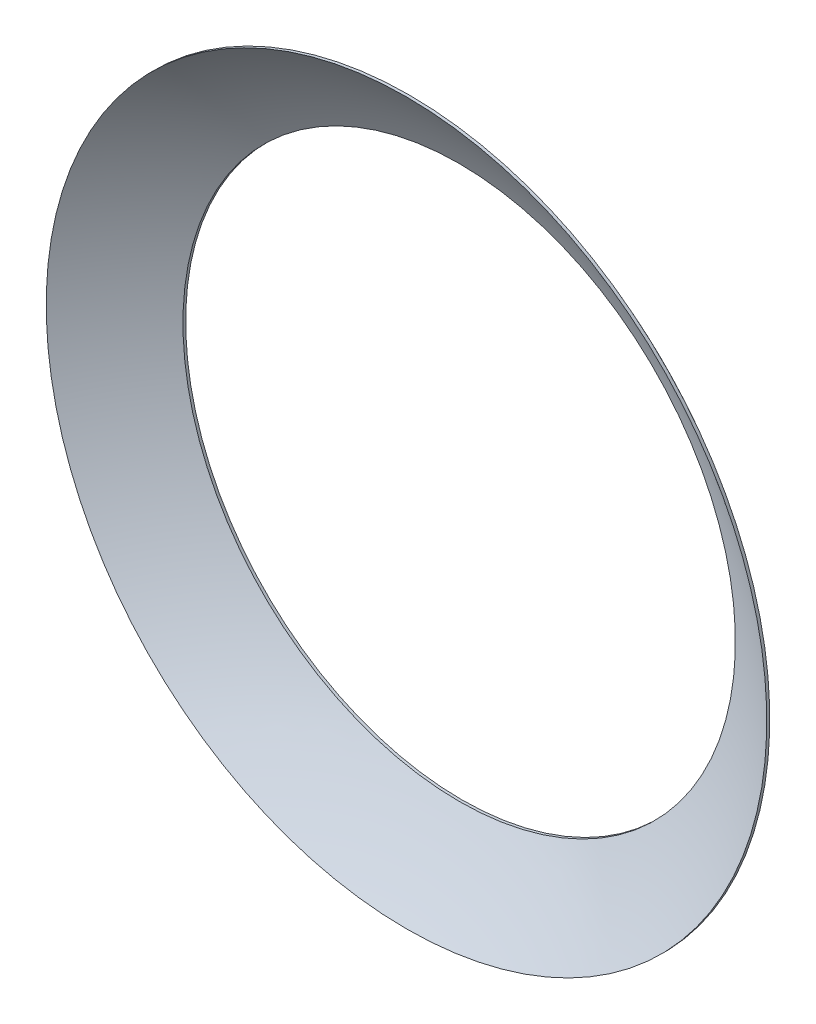
ISO-10303-21;
HEADER;
FILE_DESCRIPTION(('STEP AP214'),'2;1');
FILE_NAME('part.step','',(''),(''),'','','');
FILE_SCHEMA(('AUTOMOTIVE_DESIGN { 1 0 10303 214 1 1 1 1 }'));
ENDSEC;
DATA;
#1=APPLICATION_CONTEXT('core data for automotive mechanical design processes');
#2=APPLICATION_PROTOCOL_DEFINITION('international standard','automotive_design',2000,#1);
#3=PRODUCT_CONTEXT('',#1,'mechanical');
#4=PRODUCT('Part','Part','',(#3));
#5=PRODUCT_RELATED_PRODUCT_CATEGORY('part','',(#4));
#6=PRODUCT_DEFINITION_FORMATION('','',#4);
#7=PRODUCT_DEFINITION_CONTEXT('part definition',#1,'design');
#8=PRODUCT_DEFINITION('design','',#6,#7);
#9=PRODUCT_DEFINITION_SHAPE('','',#8);
#10=(LENGTH_UNIT() NAMED_UNIT(*) SI_UNIT(.MILLI.,.METRE.));
#11=(NAMED_UNIT(*) PLANE_ANGLE_UNIT() SI_UNIT($,.RADIAN.));
#12=(NAMED_UNIT(*) SI_UNIT($,.STERADIAN.) SOLID_ANGLE_UNIT());
#13=UNCERTAINTY_MEASURE_WITH_UNIT(LENGTH_MEASURE(1.E-05),#10,'distance_accuracy_value','');
#14=(GEOMETRIC_REPRESENTATION_CONTEXT(3) GLOBAL_UNCERTAINTY_ASSIGNED_CONTEXT((#13)) GLOBAL_UNIT_ASSIGNED_CONTEXT((#10,
#11,#12)) REPRESENTATION_CONTEXT('',''));
#15=CARTESIAN_POINT('',(0.,0.,0.));
#16=DIRECTION('',(0.,0.,1.));
#17=DIRECTION('',(1.,0.,0.));
#18=AXIS2_PLACEMENT_3D('',#15,#16,#17);
#19=CARTESIAN_POINT('',(0.,0.,0.));
#20=DIRECTION('',(0.,1.,0.));
#21=DIRECTION('',(-1.,0.,0.));
#22=AXIS2_PLACEMENT_3D('',#19,#20,#21);
#23=SPHERICAL_SURFACE('',#22,125.7);
#24=CARTESIAN_POINT('',(0.,0.,0.));
#25=DIRECTION('',(0.,0.,1.));
#26=DIRECTION('',(0.,-1.,0.));
#27=AXIS2_PLACEMENT_3D('',#24,#25,#26);
#28=SPHERICAL_SURFACE('',#27,125.7);
#29=CARTESIAN_POINT('',(0.,7.0439682012587E-13,-100.873633819745));
#30=DIRECTION('',(0.,0.,1.));
#31=DIRECTION('',(0.,-1.,0.));
#32=AXIS2_PLACEMENT_3D('',#29,#30,#31);
#33=CIRCLE('',#32,75.);
#34=CARTESIAN_POINT('',(0.,-74.9999999999993,-100.873633819746));
#35=VERTEX_POINT('',#34);
#36=EDGE_CURVE('E45',#35,#35,#33,.T.);
#37=ORIENTED_EDGE('',*,*,#36,.F.);
#38=EDGE_LOOP('',(#37));
#39=FACE_BOUND('',#38,.T.);
#40=CARTESIAN_POINT('',(0.,7.80539063207093E-13,-111.77763640371));
#41=DIRECTION('',(0.,0.,1.));
#42=DIRECTION('',(0.,-1.,0.));
#43=AXIS2_PLACEMENT_3D('',#40,#41,#42);
#44=CIRCLE('',#43,57.5);
#45=CARTESIAN_POINT('',(0.,-57.4999999999992,-111.77763640371));
#46=VERTEX_POINT('',#45);
#47=EDGE_CURVE('E11',#46,#46,#44,.T.);
#48=ORIENTED_EDGE('',*,*,#47,.T.);
#49=EDGE_LOOP('',(#48));
#50=FACE_BOUND('',#49,.T.);
#51=ADVANCED_FACE('F33',(#39,#50),#28,.T.);
#52=CARTESIAN_POINT('',(0.,0.,0.));
#53=DIRECTION('',(0.,1.,0.));
#54=DIRECTION('',(-1.,0.,0.));
#55=AXIS2_PLACEMENT_3D('',#52,#53,#54);
#56=SPHERICAL_SURFACE('',#55,125.2);
#57=CARTESIAN_POINT('',(0.,0.,0.));
#58=DIRECTION('',(0.,0.,1.));
#59=DIRECTION('',(0.,-1.,0.));
#60=AXIS2_PLACEMENT_3D('',#57,#58,#59);
#61=SPHERICAL_SURFACE('',#60,125.2);
#62=CARTESIAN_POINT('',(0.,7.00041224813369E-13,-100.249887780486));
#63=DIRECTION('',(0.,0.,1.));
#64=DIRECTION('',(0.,-1.,0.));
#65=AXIS2_PLACEMENT_3D('',#62,#63,#64);
#66=CIRCLE('',#65,75.);
#67=CARTESIAN_POINT('',(0.,-74.9999999999993,-100.249887780486));
#68=VERTEX_POINT('',#67);
#69=EDGE_CURVE('E36',#68,#68,#66,.T.);
#70=ORIENTED_EDGE('',*,*,#69,.T.);
#71=EDGE_LOOP('',(#70));
#72=FACE_BOUND('',#71,.T.);
#73=CARTESIAN_POINT('',(0.,7.76610626650814E-13,-111.215061929579));
#74=DIRECTION('',(0.,0.,1.));
#75=DIRECTION('',(0.,-1.,0.));
#76=AXIS2_PLACEMENT_3D('',#73,#74,#75);
#77=CIRCLE('',#76,57.5);
#78=CARTESIAN_POINT('',(0.,-57.4999999999992,-111.215061929579));
#79=VERTEX_POINT('',#78);
#80=EDGE_CURVE('E40',#79,#79,#77,.T.);
#81=ORIENTED_EDGE('',*,*,#80,.F.);
#82=EDGE_LOOP('',(#81));
#83=FACE_BOUND('',#82,.T.);
#84=ADVANCED_FACE('F53',(#72,#83),#61,.F.);
#85=CARTESIAN_POINT('',(0.,2.25549694489266E-12,-323.));
#86=DIRECTION('',(0.,0.,1.));
#87=DIRECTION('',(0.,-1.,0.));
#88=AXIS2_PLACEMENT_3D('',#85,#86,#87);
#89=CYLINDRICAL_SURFACE('',#88,57.5);
#90=ORIENTED_EDGE('',*,*,#47,.F.);
#91=EDGE_LOOP('',(#90));
#92=FACE_BOUND('',#91,.T.);
#93=ORIENTED_EDGE('',*,*,#80,.T.);
#94=EDGE_LOOP('',(#93));
#95=FACE_BOUND('',#94,.T.);
#96=ADVANCED_FACE('F58',(#92,#95),#89,.F.);
#97=CARTESIAN_POINT('',(0.,2.25549694489266E-12,-323.));
#98=DIRECTION('',(0.,0.,1.));
#99=DIRECTION('',(0.,-1.,0.));
#100=AXIS2_PLACEMENT_3D('',#97,#98,#99);
#101=CYLINDRICAL_SURFACE('',#100,75.);
#102=ORIENTED_EDGE('',*,*,#36,.T.);
#103=EDGE_LOOP('',(#102));
#104=FACE_BOUND('',#103,.T.);
#105=ORIENTED_EDGE('',*,*,#69,.F.);
#106=EDGE_LOOP('',(#105));
#107=FACE_BOUND('',#106,.T.);
#108=ADVANCED_FACE('F56',(#104,#107),#101,.T.);
#109=CLOSED_SHELL('',(#51,#84,#96,#108));
#110=MANIFOLD_SOLID_BREP('B2',#109);
#111=ADVANCED_BREP_SHAPE_REPRESENTATION('',(#18,#110),#14);
#112=SHAPE_DEFINITION_REPRESENTATION(#9,#111);
ENDSEC;
END-ISO-10303-21;
